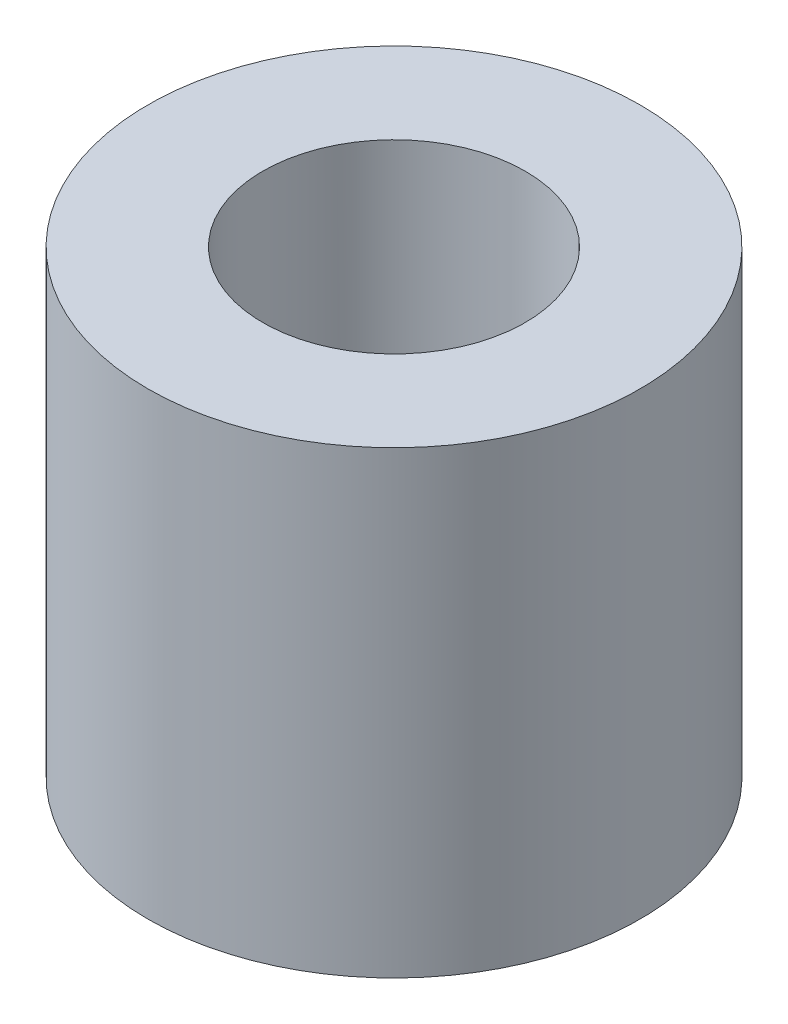
ISO-10303-21;
HEADER;
FILE_DESCRIPTION(('STEP AP214'),'2;1');
FILE_NAME('part.step','',(''),(''),'','','');
FILE_SCHEMA(('AUTOMOTIVE_DESIGN { 1 0 10303 214 1 1 1 1 }'));
ENDSEC;
DATA;
#1=APPLICATION_CONTEXT('core data for automotive mechanical design processes');
#2=APPLICATION_PROTOCOL_DEFINITION('international standard','automotive_design',2000,#1);
#3=PRODUCT_CONTEXT('',#1,'mechanical');
#4=PRODUCT('Part','Part','',(#3));
#5=PRODUCT_RELATED_PRODUCT_CATEGORY('part','',(#4));
#6=PRODUCT_DEFINITION_FORMATION('','',#4);
#7=PRODUCT_DEFINITION_CONTEXT('part definition',#1,'design');
#8=PRODUCT_DEFINITION('design','',#6,#7);
#9=PRODUCT_DEFINITION_SHAPE('','',#8);
#10=(LENGTH_UNIT() NAMED_UNIT(*) SI_UNIT(.MILLI.,.METRE.));
#11=(NAMED_UNIT(*) PLANE_ANGLE_UNIT() SI_UNIT($,.RADIAN.));
#12=(NAMED_UNIT(*) SI_UNIT($,.STERADIAN.) SOLID_ANGLE_UNIT());
#13=UNCERTAINTY_MEASURE_WITH_UNIT(LENGTH_MEASURE(1.E-05),#10,'distance_accuracy_value','');
#14=(GEOMETRIC_REPRESENTATION_CONTEXT(3) GLOBAL_UNCERTAINTY_ASSIGNED_CONTEXT((#13)) GLOBAL_UNIT_ASSIGNED_CONTEXT((#10,
#11,#12)) REPRESENTATION_CONTEXT('',''));
#15=CARTESIAN_POINT('',(0.,0.,0.));
#16=DIRECTION('',(0.,0.,1.));
#17=DIRECTION('',(1.,0.,0.));
#18=AXIS2_PLACEMENT_3D('',#15,#16,#17);
#19=CARTESIAN_POINT('',(0.,14.,0.));
#20=DIRECTION('',(0.,-1.,0.));
#21=DIRECTION('',(0.,0.,-1.));
#22=AXIS2_PLACEMENT_3D('',#19,#20,#21);
#23=CYLINDRICAL_SURFACE('',#22,7.5);
#24=CARTESIAN_POINT('',(0.,14.,0.));
#25=DIRECTION('',(0.,1.,0.));
#26=DIRECTION('',(0.,0.,1.));
#27=AXIS2_PLACEMENT_3D('',#24,#25,#26);
#28=CIRCLE('',#27,7.5);
#29=CARTESIAN_POINT('',(0.,14.,7.5));
#30=VERTEX_POINT('',#29);
#31=EDGE_CURVE('E11',#30,#30,#28,.T.);
#32=ORIENTED_EDGE('',*,*,#31,.F.);
#33=EDGE_LOOP('',(#32));
#34=FACE_BOUND('',#33,.T.);
#35=CARTESIAN_POINT('',(0.,0.,0.));
#36=DIRECTION('',(0.,1.,0.));
#37=DIRECTION('',(0.,0.,1.));
#38=AXIS2_PLACEMENT_3D('',#35,#36,#37);
#39=CIRCLE('',#38,7.5);
#40=CARTESIAN_POINT('',(0.,0.,7.5));
#41=VERTEX_POINT('',#40);
#42=EDGE_CURVE('E37',#41,#41,#39,.T.);
#43=ORIENTED_EDGE('',*,*,#42,.T.);
#44=EDGE_LOOP('',(#43));
#45=FACE_BOUND('',#44,.T.);
#46=ADVANCED_FACE('F31',(#34,#45),#23,.T.);
#47=CARTESIAN_POINT('',(0.,14.,0.));
#48=DIRECTION('',(0.,1.,0.));
#49=DIRECTION('',(0.,0.,1.));
#50=AXIS2_PLACEMENT_3D('',#47,#48,#49);
#51=PLANE('',#50);
#52=CARTESIAN_POINT('',(0.,14.,0.));
#53=DIRECTION('',(0.,-1.,0.));
#54=DIRECTION('',(0.,0.,-1.));
#55=AXIS2_PLACEMENT_3D('',#52,#53,#54);
#56=CIRCLE('',#55,4.);
#57=CARTESIAN_POINT('',(0.,14.,-4.));
#58=VERTEX_POINT('',#57);
#59=EDGE_CURVE('E64',#58,#58,#56,.T.);
#60=ORIENTED_EDGE('',*,*,#59,.T.);
#61=EDGE_LOOP('',(#60));
#62=FACE_BOUND('',#61,.T.);
#63=ORIENTED_EDGE('',*,*,#31,.T.);
#64=EDGE_LOOP('',(#63));
#65=FACE_BOUND('',#64,.T.);
#66=ADVANCED_FACE('F53',(#62,#65),#51,.T.);
#67=CARTESIAN_POINT('',(0.,0.,0.));
#68=DIRECTION('',(0.,1.,0.));
#69=DIRECTION('',(0.,0.,1.));
#70=AXIS2_PLACEMENT_3D('',#67,#68,#69);
#71=PLANE('',#70);
#72=ORIENTED_EDGE('',*,*,#42,.F.);
#73=EDGE_LOOP('',(#72));
#74=FACE_BOUND('',#73,.T.);
#75=ADVANCED_FACE('F48',(#74),#71,.F.);
#76=CARTESIAN_POINT('',(0.,0.,0.));
#77=DIRECTION('',(0.,-1.,0.));
#78=DIRECTION('',(0.,0.,-1.));
#79=AXIS2_PLACEMENT_3D('',#76,#77,#78);
#80=CYLINDRICAL_SURFACE('',#79,4.);
#81=ORIENTED_EDGE('',*,*,#59,.F.);
#82=EDGE_LOOP('',(#81));
#83=FACE_BOUND('',#82,.T.);
#84=CARTESIAN_POINT('',(0.,4.,0.));
#85=DIRECTION('',(0.,-1.,0.));
#86=DIRECTION('',(0.,0.,-1.));
#87=AXIS2_PLACEMENT_3D('',#84,#85,#86);
#88=CIRCLE('',#87,4.);
#89=CARTESIAN_POINT('',(0.,4.,-4.));
#90=VERTEX_POINT('',#89);
#91=EDGE_CURVE('E66',#90,#90,#88,.T.);
#92=ORIENTED_EDGE('',*,*,#91,.T.);
#93=EDGE_LOOP('',(#92));
#94=FACE_BOUND('',#93,.T.);
#95=ADVANCED_FACE('F42',(#83,#94),#80,.F.);
#96=CARTESIAN_POINT('',(0.,1.69059892324147,0.));
#97=DIRECTION('',(0.,1.,0.));
#98=DIRECTION('',(0.,0.,1.));
#99=AXIS2_PLACEMENT_3D('',#96,#97,#98);
#100=CONICAL_SURFACE('',#99,0.,1.04719755119659);
#101=ORIENTED_EDGE('',*,*,#91,.F.);
#102=EDGE_LOOP('',(#101));
#103=FACE_BOUND('',#102,.T.);
#104=CARTESIAN_POINT('',(0.,1.69059892324147,0.));
#105=VERTEX_POINT('',#104);
#106=VERTEX_LOOP('',#105);
#107=FACE_BOUND('',#106,.T.);
#108=ADVANCED_FACE('F40',(#103,#107),#100,.F.);
#109=CLOSED_SHELL('',(#46,#66,#75,#95,#108));
#110=MANIFOLD_SOLID_BREP('B2',#109);
#111=ADVANCED_BREP_SHAPE_REPRESENTATION('',(#18,#110),#14);
#112=SHAPE_DEFINITION_REPRESENTATION(#9,#111);
ENDSEC;
END-ISO-10303-21;
